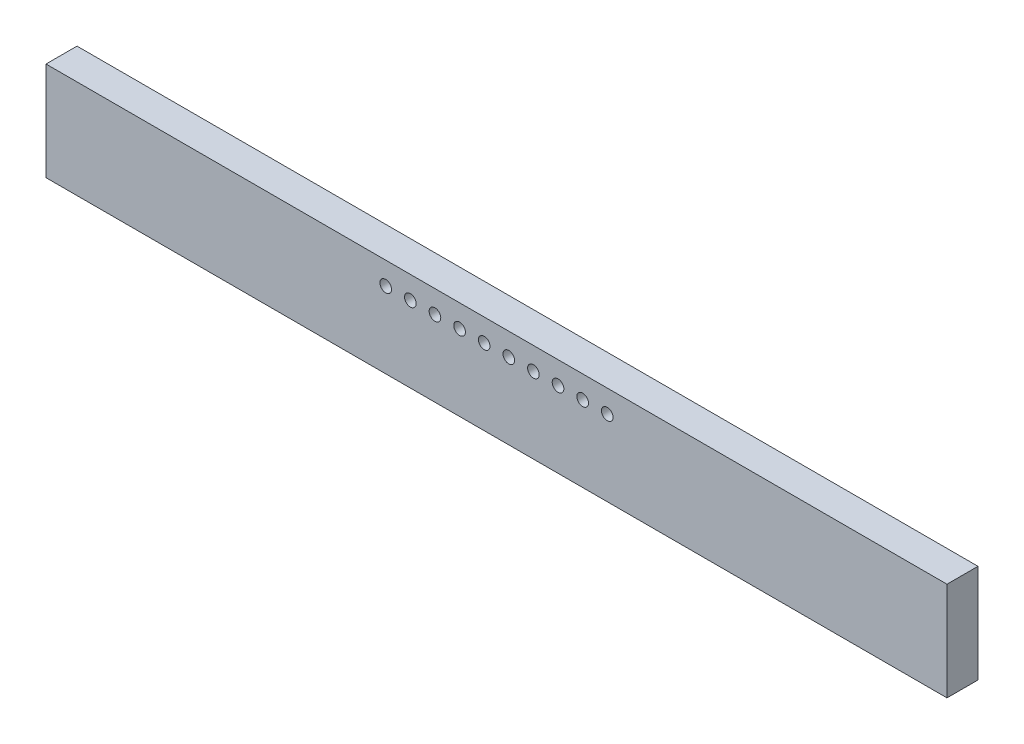
ISO-10303-21;
HEADER;
FILE_DESCRIPTION(('STEP AP214'),'2;1');
FILE_NAME('part.step','',(''),(''),'','','');
FILE_SCHEMA(('AUTOMOTIVE_DESIGN { 1 0 10303 214 1 1 1 1 }'));
ENDSEC;
DATA;
#1=APPLICATION_CONTEXT('core data for automotive mechanical design processes');
#2=APPLICATION_PROTOCOL_DEFINITION('international standard','automotive_design',2000,#1);
#3=PRODUCT_CONTEXT('',#1,'mechanical');
#4=PRODUCT('Part','Part','',(#3));
#5=PRODUCT_RELATED_PRODUCT_CATEGORY('part','',(#4));
#6=PRODUCT_DEFINITION_FORMATION('','',#4);
#7=PRODUCT_DEFINITION_CONTEXT('part definition',#1,'design');
#8=PRODUCT_DEFINITION('design','',#6,#7);
#9=PRODUCT_DEFINITION_SHAPE('','',#8);
#10=(LENGTH_UNIT() NAMED_UNIT(*) SI_UNIT(.MILLI.,.METRE.));
#11=(NAMED_UNIT(*) PLANE_ANGLE_UNIT() SI_UNIT($,.RADIAN.));
#12=(NAMED_UNIT(*) SI_UNIT($,.STERADIAN.) SOLID_ANGLE_UNIT());
#13=UNCERTAINTY_MEASURE_WITH_UNIT(LENGTH_MEASURE(1.E-05),#10,'distance_accuracy_value','');
#14=(GEOMETRIC_REPRESENTATION_CONTEXT(3) GLOBAL_UNCERTAINTY_ASSIGNED_CONTEXT((#13)) GLOBAL_UNIT_ASSIGNED_CONTEXT((#10,
#11,#12)) REPRESENTATION_CONTEXT('',''));
#15=CARTESIAN_POINT('',(0.,0.,0.));
#16=DIRECTION('',(0.,0.,1.));
#17=DIRECTION('',(1.,0.,0.));
#18=AXIS2_PLACEMENT_3D('',#15,#16,#17);
#19=CARTESIAN_POINT('',(-23.241,2.54,1.6));
#20=DIRECTION('',(0.,1.,0.));
#21=DIRECTION('',(0.,0.,1.));
#22=AXIS2_PLACEMENT_3D('',#19,#20,#21);
#23=PLANE('',#22);
#24=DIRECTION('',(1.,0.,0.));
#25=VECTOR('',#24,1.);
#26=CARTESIAN_POINT('',(-23.241,2.54,0.));
#27=LINE('',#26,#25);
#28=CARTESIAN_POINT('',(-23.241,2.54,0.));
#29=VERTEX_POINT('',#28);
#30=CARTESIAN_POINT('',(23.241,2.54,0.));
#31=VERTEX_POINT('',#30);
#32=EDGE_CURVE('E86',#29,#31,#27,.T.);
#33=ORIENTED_EDGE('',*,*,#32,.F.);
#34=DIRECTION('',(0.,0.,-1.));
#35=VECTOR('',#34,1.);
#36=CARTESIAN_POINT('',(-23.241,2.54,1.6));
#37=LINE('',#36,#35);
#38=CARTESIAN_POINT('',(-23.241,2.54,1.6));
#39=VERTEX_POINT('',#38);
#40=EDGE_CURVE('E75',#39,#29,#37,.T.);
#41=ORIENTED_EDGE('',*,*,#40,.F.);
#42=DIRECTION('',(1.,0.,0.));
#43=VECTOR('',#42,1.);
#44=CARTESIAN_POINT('',(-23.241,2.54,1.6));
#45=LINE('',#44,#43);
#46=CARTESIAN_POINT('',(23.241,2.54,1.6));
#47=VERTEX_POINT('',#46);
#48=EDGE_CURVE('E110',#39,#47,#45,.T.);
#49=ORIENTED_EDGE('',*,*,#48,.T.);
#50=DIRECTION('',(0.,0.,-1.));
#51=VECTOR('',#50,1.);
#52=CARTESIAN_POINT('',(23.241,2.54,1.6));
#53=LINE('',#52,#51);
#54=EDGE_CURVE('E87',#47,#31,#53,.T.);
#55=ORIENTED_EDGE('',*,*,#54,.T.);
#56=EDGE_LOOP('',(#33,#41,#49,#55));
#57=FACE_BOUND('',#56,.T.);
#58=ADVANCED_FACE('F32',(#57),#23,.T.);
#59=CARTESIAN_POINT('',(-23.241,-2.54,1.6));
#60=DIRECTION('',(-1.,0.,0.));
#61=DIRECTION('',(0.,0.,1.));
#62=AXIS2_PLACEMENT_3D('',#59,#60,#61);
#63=PLANE('',#62);
#64=DIRECTION('',(0.,1.,0.));
#65=VECTOR('',#64,1.);
#66=CARTESIAN_POINT('',(-23.241,-2.54,0.));
#67=LINE('',#66,#65);
#68=CARTESIAN_POINT('',(-23.241,-2.54,0.));
#69=VERTEX_POINT('',#68);
#70=EDGE_CURVE('E79',#69,#29,#67,.T.);
#71=ORIENTED_EDGE('',*,*,#70,.F.);
#72=DIRECTION('',(0.,0.,-1.));
#73=VECTOR('',#72,1.);
#74=CARTESIAN_POINT('',(-23.241,-2.54,1.6));
#75=LINE('',#74,#73);
#76=CARTESIAN_POINT('',(-23.241,-2.54,1.6));
#77=VERTEX_POINT('',#76);
#78=EDGE_CURVE('E103',#77,#69,#75,.T.);
#79=ORIENTED_EDGE('',*,*,#78,.F.);
#80=DIRECTION('',(0.,1.,0.));
#81=VECTOR('',#80,1.);
#82=CARTESIAN_POINT('',(-23.241,-2.54,1.6));
#83=LINE('',#82,#81);
#84=EDGE_CURVE('E80',#77,#39,#83,.T.);
#85=ORIENTED_EDGE('',*,*,#84,.T.);
#86=ORIENTED_EDGE('',*,*,#40,.T.);
#87=EDGE_LOOP('',(#71,#79,#85,#86));
#88=FACE_BOUND('',#87,.T.);
#89=ADVANCED_FACE('F77',(#88),#63,.T.);
#90=CARTESIAN_POINT('',(-23.241,-2.54,1.6));
#91=DIRECTION('',(0.,1.,0.));
#92=DIRECTION('',(0.,0.,1.));
#93=AXIS2_PLACEMENT_3D('',#90,#91,#92);
#94=PLANE('',#93);
#95=DIRECTION('',(1.,0.,0.));
#96=VECTOR('',#95,1.);
#97=CARTESIAN_POINT('',(-23.241,-2.54,0.));
#98=LINE('',#97,#96);
#99=CARTESIAN_POINT('',(23.241,-2.54,0.));
#100=VERTEX_POINT('',#99);
#101=EDGE_CURVE('E83',#69,#100,#98,.T.);
#102=ORIENTED_EDGE('',*,*,#101,.T.);
#103=DIRECTION('',(0.,0.,-1.));
#104=VECTOR('',#103,1.);
#105=CARTESIAN_POINT('',(23.241,-2.54,1.6));
#106=LINE('',#105,#104);
#107=CARTESIAN_POINT('',(23.241,-2.54,1.6));
#108=VERTEX_POINT('',#107);
#109=EDGE_CURVE('E105',#108,#100,#106,.T.);
#110=ORIENTED_EDGE('',*,*,#109,.F.);
#111=DIRECTION('',(1.,0.,0.));
#112=VECTOR('',#111,1.);
#113=CARTESIAN_POINT('',(-23.241,-2.54,1.6));
#114=LINE('',#113,#112);
#115=EDGE_CURVE('E53',#77,#108,#114,.T.);
#116=ORIENTED_EDGE('',*,*,#115,.F.);
#117=ORIENTED_EDGE('',*,*,#78,.T.);
#118=EDGE_LOOP('',(#102,#110,#116,#117));
#119=FACE_BOUND('',#118,.T.);
#120=ADVANCED_FACE('F212',(#119),#94,.F.);
#121=CARTESIAN_POINT('',(23.241,-2.54,1.6));
#122=DIRECTION('',(-1.,0.,0.));
#123=DIRECTION('',(0.,0.,1.));
#124=AXIS2_PLACEMENT_3D('',#121,#122,#123);
#125=PLANE('',#124);
#126=DIRECTION('',(0.,1.,0.));
#127=VECTOR('',#126,1.);
#128=CARTESIAN_POINT('',(23.241,-2.54,0.));
#129=LINE('',#128,#127);
#130=EDGE_CURVE('E104',#100,#31,#129,.T.);
#131=ORIENTED_EDGE('',*,*,#130,.T.);
#132=ORIENTED_EDGE('',*,*,#54,.F.);
#133=DIRECTION('',(0.,1.,0.));
#134=VECTOR('',#133,1.);
#135=CARTESIAN_POINT('',(23.241,-2.54,1.6));
#136=LINE('',#135,#134);
#137=EDGE_CURVE('E48',#108,#47,#136,.T.);
#138=ORIENTED_EDGE('',*,*,#137,.F.);
#139=ORIENTED_EDGE('',*,*,#109,.T.);
#140=EDGE_LOOP('',(#131,#132,#138,#139));
#141=FACE_BOUND('',#140,.T.);
#142=ADVANCED_FACE('F174',(#141),#125,.F.);
#143=CARTESIAN_POINT('',(0.,0.,1.6));
#144=DIRECTION('',(0.,0.,1.));
#145=DIRECTION('',(1.,0.,0.));
#146=AXIS2_PLACEMENT_3D('',#143,#144,#145);
#147=PLANE('',#146);
#148=CARTESIAN_POINT('',(-5.71500000000002,1.38000000000002,1.6));
#149=DIRECTION('',(0.,0.,1.));
#150=DIRECTION('',(1.,0.,0.));
#151=AXIS2_PLACEMENT_3D('',#148,#149,#150);
#152=CIRCLE('',#151,0.3);
#153=CARTESIAN_POINT('',(-5.41500000000002,1.38000000000002,1.6));
#154=VERTEX_POINT('',#153);
#155=EDGE_CURVE('E11',#154,#154,#152,.T.);
#156=ORIENTED_EDGE('',*,*,#155,.F.);
#157=EDGE_LOOP('',(#156));
#158=FACE_BOUND('',#157,.T.);
#159=CARTESIAN_POINT('',(-4.44500000000002,1.38000000000002,1.6));
#160=DIRECTION('',(0.,0.,1.));
#161=DIRECTION('',(1.,0.,0.));
#162=AXIS2_PLACEMENT_3D('',#159,#160,#161);
#163=CIRCLE('',#162,0.3);
#164=CARTESIAN_POINT('',(-4.14500000000002,1.38000000000002,1.6));
#165=VERTEX_POINT('',#164);
#166=EDGE_CURVE('E41',#165,#165,#163,.T.);
#167=ORIENTED_EDGE('',*,*,#166,.F.);
#168=EDGE_LOOP('',(#167));
#169=FACE_BOUND('',#168,.T.);
#170=CARTESIAN_POINT('',(-3.17500000000002,1.38000000000002,1.6));
#171=DIRECTION('',(0.,0.,1.));
#172=DIRECTION('',(1.,0.,0.));
#173=AXIS2_PLACEMENT_3D('',#170,#171,#172);
#174=CIRCLE('',#173,0.3);
#175=CARTESIAN_POINT('',(-2.87500000000002,1.38000000000002,1.6));
#176=VERTEX_POINT('',#175);
#177=EDGE_CURVE('E147',#176,#176,#174,.T.);
#178=ORIENTED_EDGE('',*,*,#177,.F.);
#179=EDGE_LOOP('',(#178));
#180=FACE_BOUND('',#179,.T.);
#181=CARTESIAN_POINT('',(-1.90500000000002,1.38000000000002,1.6));
#182=DIRECTION('',(0.,0.,1.));
#183=DIRECTION('',(1.,0.,0.));
#184=AXIS2_PLACEMENT_3D('',#181,#182,#183);
#185=CIRCLE('',#184,0.3);
#186=CARTESIAN_POINT('',(-1.60500000000002,1.38000000000002,1.6));
#187=VERTEX_POINT('',#186);
#188=EDGE_CURVE('E141',#187,#187,#185,.T.);
#189=ORIENTED_EDGE('',*,*,#188,.F.);
#190=EDGE_LOOP('',(#189));
#191=FACE_BOUND('',#190,.T.);
#192=CARTESIAN_POINT('',(-0.635000000000018,1.38000000000002,1.6));
#193=DIRECTION('',(0.,0.,1.));
#194=DIRECTION('',(1.,0.,0.));
#195=AXIS2_PLACEMENT_3D('',#192,#193,#194);
#196=CIRCLE('',#195,0.3);
#197=CARTESIAN_POINT('',(-0.335000000000018,1.38000000000002,1.6));
#198=VERTEX_POINT('',#197);
#199=EDGE_CURVE('E135',#198,#198,#196,.T.);
#200=ORIENTED_EDGE('',*,*,#199,.F.);
#201=EDGE_LOOP('',(#200));
#202=FACE_BOUND('',#201,.T.);
#203=CARTESIAN_POINT('',(0.634999999999982,1.38000000000002,1.6));
#204=DIRECTION('',(0.,0.,1.));
#205=DIRECTION('',(1.,0.,0.));
#206=AXIS2_PLACEMENT_3D('',#203,#204,#205);
#207=CIRCLE('',#206,0.3);
#208=CARTESIAN_POINT('',(0.934999999999982,1.38000000000002,1.6));
#209=VERTEX_POINT('',#208);
#210=EDGE_CURVE('E129',#209,#209,#207,.T.);
#211=ORIENTED_EDGE('',*,*,#210,.F.);
#212=EDGE_LOOP('',(#211));
#213=FACE_BOUND('',#212,.T.);
#214=CARTESIAN_POINT('',(1.90499999999998,1.38000000000002,1.6));
#215=DIRECTION('',(0.,0.,1.));
#216=DIRECTION('',(1.,0.,0.));
#217=AXIS2_PLACEMENT_3D('',#214,#215,#216);
#218=CIRCLE('',#217,0.3);
#219=CARTESIAN_POINT('',(2.20499999999998,1.38000000000002,1.6));
#220=VERTEX_POINT('',#219);
#221=EDGE_CURVE('E123',#220,#220,#218,.T.);
#222=ORIENTED_EDGE('',*,*,#221,.F.);
#223=EDGE_LOOP('',(#222));
#224=FACE_BOUND('',#223,.T.);
#225=CARTESIAN_POINT('',(3.17499999999998,1.38000000000002,1.6));
#226=DIRECTION('',(0.,0.,1.));
#227=DIRECTION('',(1.,0.,0.));
#228=AXIS2_PLACEMENT_3D('',#225,#226,#227);
#229=CIRCLE('',#228,0.3);
#230=CARTESIAN_POINT('',(3.47499999999998,1.38000000000002,1.6));
#231=VERTEX_POINT('',#230);
#232=EDGE_CURVE('E117',#231,#231,#229,.T.);
#233=ORIENTED_EDGE('',*,*,#232,.F.);
#234=EDGE_LOOP('',(#233));
#235=FACE_BOUND('',#234,.T.);
#236=CARTESIAN_POINT('',(4.44499999999998,1.38000000000002,1.6));
#237=DIRECTION('',(0.,0.,1.));
#238=DIRECTION('',(1.,0.,0.));
#239=AXIS2_PLACEMENT_3D('',#236,#237,#238);
#240=CIRCLE('',#239,0.3);
#241=CARTESIAN_POINT('',(4.74499999999998,1.38000000000002,1.6));
#242=VERTEX_POINT('',#241);
#243=EDGE_CURVE('E98',#242,#242,#240,.T.);
#244=ORIENTED_EDGE('',*,*,#243,.F.);
#245=EDGE_LOOP('',(#244));
#246=FACE_BOUND('',#245,.T.);
#247=CARTESIAN_POINT('',(5.71499999999998,1.38000000000002,1.6));
#248=DIRECTION('',(0.,0.,1.));
#249=DIRECTION('',(1.,0.,0.));
#250=AXIS2_PLACEMENT_3D('',#247,#248,#249);
#251=CIRCLE('',#250,0.3);
#252=CARTESIAN_POINT('',(6.01499999999998,1.38000000000002,1.6));
#253=VERTEX_POINT('',#252);
#254=EDGE_CURVE('E95',#253,#253,#251,.T.);
#255=ORIENTED_EDGE('',*,*,#254,.F.);
#256=EDGE_LOOP('',(#255));
#257=FACE_BOUND('',#256,.T.);
#258=ORIENTED_EDGE('',*,*,#48,.F.);
#259=ORIENTED_EDGE('',*,*,#84,.F.);
#260=ORIENTED_EDGE('',*,*,#115,.T.);
#261=ORIENTED_EDGE('',*,*,#137,.T.);
#262=EDGE_LOOP('',(#258,#259,#260,#261));
#263=FACE_BOUND('',#262,.T.);
#264=ADVANCED_FACE('F34',(#158,#169,#180,#191,#202,#213,#224,#235,#246,#257,#263),#147,.T.);
#265=CARTESIAN_POINT('',(0.,0.,0.));
#266=DIRECTION('',(0.,0.,1.));
#267=DIRECTION('',(1.,0.,0.));
#268=AXIS2_PLACEMENT_3D('',#265,#266,#267);
#269=PLANE('',#268);
#270=CARTESIAN_POINT('',(-5.71500000000002,1.38000000000002,0.));
#271=DIRECTION('',(0.,0.,1.));
#272=DIRECTION('',(1.,0.,0.));
#273=AXIS2_PLACEMENT_3D('',#270,#271,#272);
#274=CIRCLE('',#273,0.3);
#275=CARTESIAN_POINT('',(-5.41500000000002,1.38000000000002,0.));
#276=VERTEX_POINT('',#275);
#277=EDGE_CURVE('E36',#276,#276,#274,.T.);
#278=ORIENTED_EDGE('',*,*,#277,.T.);
#279=EDGE_LOOP('',(#278));
#280=FACE_BOUND('',#279,.T.);
#281=CARTESIAN_POINT('',(-4.44500000000002,1.38000000000002,0.));
#282=DIRECTION('',(0.,0.,1.));
#283=DIRECTION('',(1.,0.,0.));
#284=AXIS2_PLACEMENT_3D('',#281,#282,#283);
#285=CIRCLE('',#284,0.3);
#286=CARTESIAN_POINT('',(-4.14500000000002,1.38000000000002,0.));
#287=VERTEX_POINT('',#286);
#288=EDGE_CURVE('E155',#287,#287,#285,.T.);
#289=ORIENTED_EDGE('',*,*,#288,.T.);
#290=EDGE_LOOP('',(#289));
#291=FACE_BOUND('',#290,.T.);
#292=CARTESIAN_POINT('',(-3.17500000000002,1.38000000000002,0.));
#293=DIRECTION('',(0.,0.,1.));
#294=DIRECTION('',(1.,0.,0.));
#295=AXIS2_PLACEMENT_3D('',#292,#293,#294);
#296=CIRCLE('',#295,0.3);
#297=CARTESIAN_POINT('',(-2.87500000000002,1.38000000000002,0.));
#298=VERTEX_POINT('',#297);
#299=EDGE_CURVE('E150',#298,#298,#296,.T.);
#300=ORIENTED_EDGE('',*,*,#299,.T.);
#301=EDGE_LOOP('',(#300));
#302=FACE_BOUND('',#301,.T.);
#303=CARTESIAN_POINT('',(-1.90500000000002,1.38000000000002,0.));
#304=DIRECTION('',(0.,0.,1.));
#305=DIRECTION('',(1.,0.,0.));
#306=AXIS2_PLACEMENT_3D('',#303,#304,#305);
#307=CIRCLE('',#306,0.3);
#308=CARTESIAN_POINT('',(-1.60500000000002,1.38000000000002,0.));
#309=VERTEX_POINT('',#308);
#310=EDGE_CURVE('E144',#309,#309,#307,.T.);
#311=ORIENTED_EDGE('',*,*,#310,.T.);
#312=EDGE_LOOP('',(#311));
#313=FACE_BOUND('',#312,.T.);
#314=CARTESIAN_POINT('',(-0.635000000000018,1.38000000000002,0.));
#315=DIRECTION('',(0.,0.,1.));
#316=DIRECTION('',(1.,0.,0.));
#317=AXIS2_PLACEMENT_3D('',#314,#315,#316);
#318=CIRCLE('',#317,0.3);
#319=CARTESIAN_POINT('',(-0.335000000000018,1.38000000000002,0.));
#320=VERTEX_POINT('',#319);
#321=EDGE_CURVE('E138',#320,#320,#318,.T.);
#322=ORIENTED_EDGE('',*,*,#321,.T.);
#323=EDGE_LOOP('',(#322));
#324=FACE_BOUND('',#323,.T.);
#325=CARTESIAN_POINT('',(0.634999999999982,1.38000000000002,0.));
#326=DIRECTION('',(0.,0.,1.));
#327=DIRECTION('',(1.,0.,0.));
#328=AXIS2_PLACEMENT_3D('',#325,#326,#327);
#329=CIRCLE('',#328,0.3);
#330=CARTESIAN_POINT('',(0.934999999999982,1.38000000000002,0.));
#331=VERTEX_POINT('',#330);
#332=EDGE_CURVE('E132',#331,#331,#329,.T.);
#333=ORIENTED_EDGE('',*,*,#332,.T.);
#334=EDGE_LOOP('',(#333));
#335=FACE_BOUND('',#334,.T.);
#336=CARTESIAN_POINT('',(1.90499999999998,1.38000000000002,0.));
#337=DIRECTION('',(0.,0.,1.));
#338=DIRECTION('',(1.,0.,0.));
#339=AXIS2_PLACEMENT_3D('',#336,#337,#338);
#340=CIRCLE('',#339,0.3);
#341=CARTESIAN_POINT('',(2.20499999999998,1.38000000000002,0.));
#342=VERTEX_POINT('',#341);
#343=EDGE_CURVE('E126',#342,#342,#340,.T.);
#344=ORIENTED_EDGE('',*,*,#343,.T.);
#345=EDGE_LOOP('',(#344));
#346=FACE_BOUND('',#345,.T.);
#347=CARTESIAN_POINT('',(3.17499999999998,1.38000000000002,0.));
#348=DIRECTION('',(0.,0.,1.));
#349=DIRECTION('',(1.,0.,0.));
#350=AXIS2_PLACEMENT_3D('',#347,#348,#349);
#351=CIRCLE('',#350,0.3);
#352=CARTESIAN_POINT('',(3.47499999999998,1.38000000000002,0.));
#353=VERTEX_POINT('',#352);
#354=EDGE_CURVE('E120',#353,#353,#351,.T.);
#355=ORIENTED_EDGE('',*,*,#354,.T.);
#356=EDGE_LOOP('',(#355));
#357=FACE_BOUND('',#356,.T.);
#358=CARTESIAN_POINT('',(4.44499999999998,1.38000000000002,0.));
#359=DIRECTION('',(0.,0.,1.));
#360=DIRECTION('',(1.,0.,0.));
#361=AXIS2_PLACEMENT_3D('',#358,#359,#360);
#362=CIRCLE('',#361,0.3);
#363=CARTESIAN_POINT('',(4.74499999999998,1.38000000000002,0.));
#364=VERTEX_POINT('',#363);
#365=EDGE_CURVE('E114',#364,#364,#362,.T.);
#366=ORIENTED_EDGE('',*,*,#365,.T.);
#367=EDGE_LOOP('',(#366));
#368=FACE_BOUND('',#367,.T.);
#369=CARTESIAN_POINT('',(5.71499999999998,1.38000000000002,0.));
#370=DIRECTION('',(0.,0.,1.));
#371=DIRECTION('',(1.,0.,0.));
#372=AXIS2_PLACEMENT_3D('',#369,#370,#371);
#373=CIRCLE('',#372,0.3);
#374=CARTESIAN_POINT('',(6.01499999999998,1.38000000000002,0.));
#375=VERTEX_POINT('',#374);
#376=EDGE_CURVE('E91',#375,#375,#373,.T.);
#377=ORIENTED_EDGE('',*,*,#376,.T.);
#378=EDGE_LOOP('',(#377));
#379=FACE_BOUND('',#378,.T.);
#380=ORIENTED_EDGE('',*,*,#32,.T.);
#381=ORIENTED_EDGE('',*,*,#130,.F.);
#382=ORIENTED_EDGE('',*,*,#101,.F.);
#383=ORIENTED_EDGE('',*,*,#70,.T.);
#384=EDGE_LOOP('',(#380,#381,#382,#383));
#385=FACE_BOUND('',#384,.T.);
#386=ADVANCED_FACE('F94',(#280,#291,#302,#313,#324,#335,#346,#357,#368,#379,#385),#269,.F.);
#387=CARTESIAN_POINT('',(5.71499999999998,1.38000000000002,0.));
#388=DIRECTION('',(0.,0.,1.));
#389=DIRECTION('',(1.,0.,0.));
#390=AXIS2_PLACEMENT_3D('',#387,#388,#389);
#391=CYLINDRICAL_SURFACE('',#390,0.3);
#392=ORIENTED_EDGE('',*,*,#376,.F.);
#393=EDGE_LOOP('',(#392));
#394=FACE_BOUND('',#393,.T.);
#395=ORIENTED_EDGE('',*,*,#254,.T.);
#396=EDGE_LOOP('',(#395));
#397=FACE_BOUND('',#396,.T.);
#398=ADVANCED_FACE('F193',(#394,#397),#391,.F.);
#399=CARTESIAN_POINT('',(4.44499999999998,1.38000000000002,0.));
#400=DIRECTION('',(0.,0.,1.));
#401=DIRECTION('',(1.,0.,0.));
#402=AXIS2_PLACEMENT_3D('',#399,#400,#401);
#403=CYLINDRICAL_SURFACE('',#402,0.3);
#404=ORIENTED_EDGE('',*,*,#365,.F.);
#405=EDGE_LOOP('',(#404));
#406=FACE_BOUND('',#405,.T.);
#407=ORIENTED_EDGE('',*,*,#243,.T.);
#408=EDGE_LOOP('',(#407));
#409=FACE_BOUND('',#408,.T.);
#410=ADVANCED_FACE('F195',(#406,#409),#403,.F.);
#411=CARTESIAN_POINT('',(3.17499999999998,1.38000000000002,0.));
#412=DIRECTION('',(0.,0.,1.));
#413=DIRECTION('',(1.,0.,0.));
#414=AXIS2_PLACEMENT_3D('',#411,#412,#413);
#415=CYLINDRICAL_SURFACE('',#414,0.3);
#416=ORIENTED_EDGE('',*,*,#354,.F.);
#417=EDGE_LOOP('',(#416));
#418=FACE_BOUND('',#417,.T.);
#419=ORIENTED_EDGE('',*,*,#232,.T.);
#420=EDGE_LOOP('',(#419));
#421=FACE_BOUND('',#420,.T.);
#422=ADVANCED_FACE('F202',(#418,#421),#415,.F.);
#423=CARTESIAN_POINT('',(1.90499999999998,1.38000000000002,0.));
#424=DIRECTION('',(0.,0.,1.));
#425=DIRECTION('',(1.,0.,0.));
#426=AXIS2_PLACEMENT_3D('',#423,#424,#425);
#427=CYLINDRICAL_SURFACE('',#426,0.3);
#428=ORIENTED_EDGE('',*,*,#343,.F.);
#429=EDGE_LOOP('',(#428));
#430=FACE_BOUND('',#429,.T.);
#431=ORIENTED_EDGE('',*,*,#221,.T.);
#432=EDGE_LOOP('',(#431));
#433=FACE_BOUND('',#432,.T.);
#434=ADVANCED_FACE('F257',(#430,#433),#427,.F.);
#435=CARTESIAN_POINT('',(0.634999999999982,1.38000000000002,0.));
#436=DIRECTION('',(0.,0.,1.));
#437=DIRECTION('',(1.,0.,0.));
#438=AXIS2_PLACEMENT_3D('',#435,#436,#437);
#439=CYLINDRICAL_SURFACE('',#438,0.3);
#440=ORIENTED_EDGE('',*,*,#332,.F.);
#441=EDGE_LOOP('',(#440));
#442=FACE_BOUND('',#441,.T.);
#443=ORIENTED_EDGE('',*,*,#210,.T.);
#444=EDGE_LOOP('',(#443));
#445=FACE_BOUND('',#444,.T.);
#446=ADVANCED_FACE('F267',(#442,#445),#439,.F.);
#447=CARTESIAN_POINT('',(-0.635000000000018,1.38000000000002,0.));
#448=DIRECTION('',(0.,0.,1.));
#449=DIRECTION('',(1.,0.,0.));
#450=AXIS2_PLACEMENT_3D('',#447,#448,#449);
#451=CYLINDRICAL_SURFACE('',#450,0.3);
#452=ORIENTED_EDGE('',*,*,#321,.F.);
#453=EDGE_LOOP('',(#452));
#454=FACE_BOUND('',#453,.T.);
#455=ORIENTED_EDGE('',*,*,#199,.T.);
#456=EDGE_LOOP('',(#455));
#457=FACE_BOUND('',#456,.T.);
#458=ADVANCED_FACE('F277',(#454,#457),#451,.F.);
#459=CARTESIAN_POINT('',(-1.90500000000002,1.38000000000002,0.));
#460=DIRECTION('',(0.,0.,1.));
#461=DIRECTION('',(1.,0.,0.));
#462=AXIS2_PLACEMENT_3D('',#459,#460,#461);
#463=CYLINDRICAL_SURFACE('',#462,0.3);
#464=ORIENTED_EDGE('',*,*,#310,.F.);
#465=EDGE_LOOP('',(#464));
#466=FACE_BOUND('',#465,.T.);
#467=ORIENTED_EDGE('',*,*,#188,.T.);
#468=EDGE_LOOP('',(#467));
#469=FACE_BOUND('',#468,.T.);
#470=ADVANCED_FACE('F287',(#466,#469),#463,.F.);
#471=CARTESIAN_POINT('',(-3.17500000000002,1.38000000000002,0.));
#472=DIRECTION('',(0.,0.,1.));
#473=DIRECTION('',(1.,0.,0.));
#474=AXIS2_PLACEMENT_3D('',#471,#472,#473);
#475=CYLINDRICAL_SURFACE('',#474,0.3);
#476=ORIENTED_EDGE('',*,*,#299,.F.);
#477=EDGE_LOOP('',(#476));
#478=FACE_BOUND('',#477,.T.);
#479=ORIENTED_EDGE('',*,*,#177,.T.);
#480=EDGE_LOOP('',(#479));
#481=FACE_BOUND('',#480,.T.);
#482=ADVANCED_FACE('F297',(#478,#481),#475,.F.);
#483=CARTESIAN_POINT('',(-4.44500000000002,1.38000000000002,0.));
#484=DIRECTION('',(0.,0.,1.));
#485=DIRECTION('',(1.,0.,0.));
#486=AXIS2_PLACEMENT_3D('',#483,#484,#485);
#487=CYLINDRICAL_SURFACE('',#486,0.3);
#488=ORIENTED_EDGE('',*,*,#288,.F.);
#489=EDGE_LOOP('',(#488));
#490=FACE_BOUND('',#489,.T.);
#491=ORIENTED_EDGE('',*,*,#166,.T.);
#492=EDGE_LOOP('',(#491));
#493=FACE_BOUND('',#492,.T.);
#494=ADVANCED_FACE('F168',(#490,#493),#487,.F.);
#495=CARTESIAN_POINT('',(-5.71500000000002,1.38000000000002,0.));
#496=DIRECTION('',(0.,0.,1.));
#497=DIRECTION('',(1.,0.,0.));
#498=AXIS2_PLACEMENT_3D('',#495,#496,#497);
#499=CYLINDRICAL_SURFACE('',#498,0.3);
#500=ORIENTED_EDGE('',*,*,#277,.F.);
#501=EDGE_LOOP('',(#500));
#502=FACE_BOUND('',#501,.T.);
#503=ORIENTED_EDGE('',*,*,#155,.T.);
#504=EDGE_LOOP('',(#503));
#505=FACE_BOUND('',#504,.T.);
#506=ADVANCED_FACE('F165',(#502,#505),#499,.F.);
#507=CLOSED_SHELL('',(#58,#89,#120,#142,#264,#386,#398,#410,#422,#434,#446,#458,#470,#482,#494,#506));
#508=MANIFOLD_SOLID_BREP('B2',#507);
#509=ADVANCED_BREP_SHAPE_REPRESENTATION('',(#18,#508),#14);
#510=SHAPE_DEFINITION_REPRESENTATION(#9,#509);
ENDSEC;
END-ISO-10303-21;
